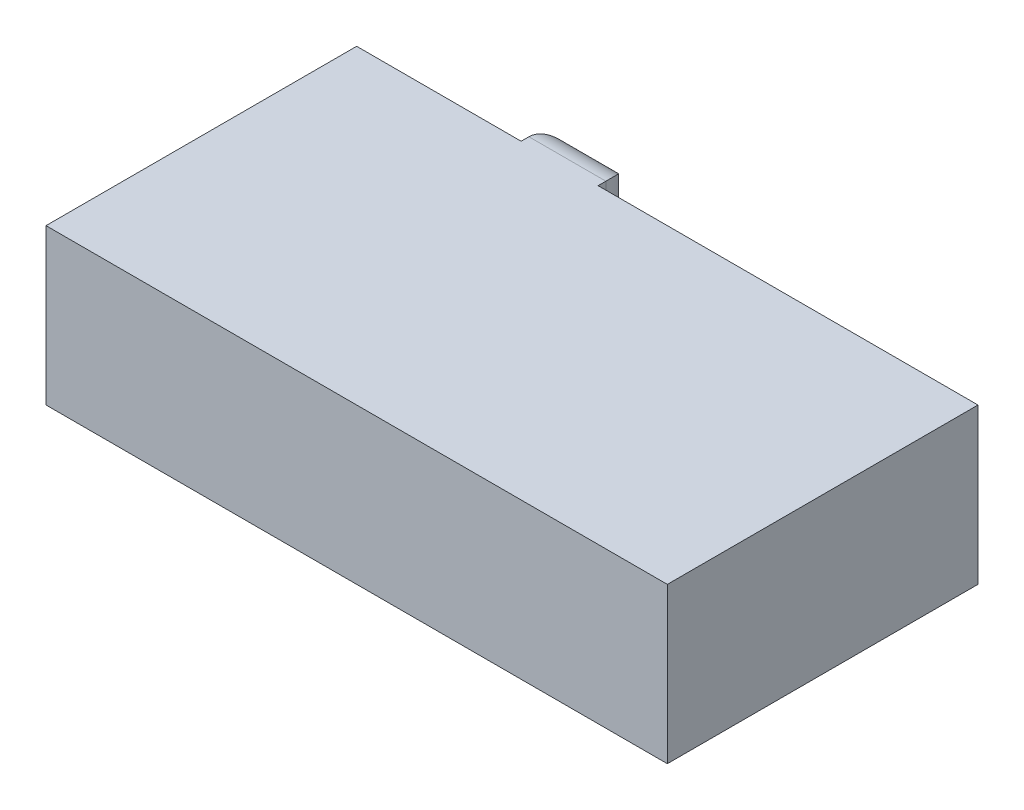
ISO-10303-21;
HEADER;
FILE_DESCRIPTION(('STEP AP214'),'2;1');
FILE_NAME('part.step','',(''),(''),'','','');
FILE_SCHEMA(('AUTOMOTIVE_DESIGN { 1 0 10303 214 1 1 1 1 }'));
ENDSEC;
DATA;
#1=APPLICATION_CONTEXT('core data for automotive mechanical design processes');
#2=APPLICATION_PROTOCOL_DEFINITION('international standard','automotive_design',2000,#1);
#3=PRODUCT_CONTEXT('',#1,'mechanical');
#4=PRODUCT('Part','Part','',(#3));
#5=PRODUCT_RELATED_PRODUCT_CATEGORY('part','',(#4));
#6=PRODUCT_DEFINITION_FORMATION('','',#4);
#7=PRODUCT_DEFINITION_CONTEXT('part definition',#1,'design');
#8=PRODUCT_DEFINITION('design','',#6,#7);
#9=PRODUCT_DEFINITION_SHAPE('','',#8);
#10=(LENGTH_UNIT() NAMED_UNIT(*) SI_UNIT(.MILLI.,.METRE.));
#11=(NAMED_UNIT(*) PLANE_ANGLE_UNIT() SI_UNIT($,.RADIAN.));
#12=(NAMED_UNIT(*) SI_UNIT($,.STERADIAN.) SOLID_ANGLE_UNIT());
#13=UNCERTAINTY_MEASURE_WITH_UNIT(LENGTH_MEASURE(1.E-05),#10,'distance_accuracy_value','');
#14=(GEOMETRIC_REPRESENTATION_CONTEXT(3) GLOBAL_UNCERTAINTY_ASSIGNED_CONTEXT((#13)) GLOBAL_UNIT_ASSIGNED_CONTEXT((#10,
#11,#12)) REPRESENTATION_CONTEXT('',''));
#15=CARTESIAN_POINT('',(0.,0.,0.));
#16=DIRECTION('',(0.,0.,1.));
#17=DIRECTION('',(1.,0.,0.));
#18=AXIS2_PLACEMENT_3D('',#15,#16,#17);
#19=CARTESIAN_POINT('',(0.,5.08,-10.16));
#20=DIRECTION('',(0.,0.,1.));
#21=DIRECTION('',(1.,0.,0.));
#22=AXIS2_PLACEMENT_3D('',#19,#20,#21);
#23=PLANE('',#22);
#24=DIRECTION('',(0.,-1.,0.));
#25=VECTOR('',#24,1.);
#26=CARTESIAN_POINT('',(7.89604556988621,5.08,-10.16));
#27=LINE('',#26,#25);
#28=CARTESIAN_POINT('',(7.89604556988621,5.08,-10.16));
#29=VERTEX_POINT('',#28);
#30=CARTESIAN_POINT('',(7.89604556988621,0.,-10.16));
#31=VERTEX_POINT('',#30);
#32=EDGE_CURVE('E123',#29,#31,#27,.T.);
#33=ORIENTED_EDGE('',*,*,#32,.F.);
#34=DIRECTION('',(-1.,0.,0.));
#35=VECTOR('',#34,1.);
#36=CARTESIAN_POINT('',(0.,5.08,-10.16));
#37=LINE('',#36,#35);
#38=CARTESIAN_POINT('',(20.32,5.08,-10.16));
#39=VERTEX_POINT('',#38);
#40=EDGE_CURVE('E151',#39,#29,#37,.T.);
#41=ORIENTED_EDGE('',*,*,#40,.F.);
#42=DIRECTION('',(0.,-1.,0.));
#43=VECTOR('',#42,1.);
#44=CARTESIAN_POINT('',(20.32,5.08,-10.16));
#45=LINE('',#44,#43);
#46=CARTESIAN_POINT('',(20.32,0.,-10.16));
#47=VERTEX_POINT('',#46);
#48=EDGE_CURVE('E126',#39,#47,#45,.T.);
#49=ORIENTED_EDGE('',*,*,#48,.T.);
#50=DIRECTION('',(-1.,0.,0.));
#51=VECTOR('',#50,1.);
#52=CARTESIAN_POINT('',(0.,0.,-10.16));
#53=LINE('',#52,#51);
#54=EDGE_CURVE('E112',#47,#31,#53,.T.);
#55=ORIENTED_EDGE('',*,*,#54,.T.);
#56=EDGE_LOOP('',(#33,#41,#49,#55));
#57=FACE_BOUND('',#56,.T.);
#58=ADVANCED_FACE('F33',(#57),#23,.F.);
#59=CARTESIAN_POINT('',(0.,5.08,0.));
#60=DIRECTION('',(1.,0.,0.));
#61=DIRECTION('',(0.,0.,-1.));
#62=AXIS2_PLACEMENT_3D('',#59,#60,#61);
#63=PLANE('',#62);
#64=DIRECTION('',(0.,0.,1.));
#65=VECTOR('',#64,1.);
#66=CARTESIAN_POINT('',(0.,0.,0.));
#67=LINE('',#66,#65);
#68=CARTESIAN_POINT('',(0.,0.,-10.16));
#69=VERTEX_POINT('',#68);
#70=CARTESIAN_POINT('',(0.,0.,0.));
#71=VERTEX_POINT('',#70);
#72=EDGE_CURVE('E143',#69,#71,#67,.T.);
#73=ORIENTED_EDGE('',*,*,#72,.T.);
#74=DIRECTION('',(0.,-1.,0.));
#75=VECTOR('',#74,1.);
#76=CARTESIAN_POINT('',(0.,5.08,0.));
#77=LINE('',#76,#75);
#78=CARTESIAN_POINT('',(0.,5.08,0.));
#79=VERTEX_POINT('',#78);
#80=EDGE_CURVE('E166',#79,#71,#77,.T.);
#81=ORIENTED_EDGE('',*,*,#80,.F.);
#82=DIRECTION('',(0.,0.,1.));
#83=VECTOR('',#82,1.);
#84=CARTESIAN_POINT('',(0.,5.08,0.));
#85=LINE('',#84,#83);
#86=CARTESIAN_POINT('',(0.,5.08,-10.16));
#87=VERTEX_POINT('',#86);
#88=EDGE_CURVE('E127',#87,#79,#85,.T.);
#89=ORIENTED_EDGE('',*,*,#88,.F.);
#90=DIRECTION('',(0.,-1.,0.));
#91=VECTOR('',#90,1.);
#92=CARTESIAN_POINT('',(0.,5.08,-10.16));
#93=LINE('',#92,#91);
#94=EDGE_CURVE('E153',#87,#69,#93,.T.);
#95=ORIENTED_EDGE('',*,*,#94,.T.);
#96=EDGE_LOOP('',(#73,#81,#89,#95));
#97=FACE_BOUND('',#96,.T.);
#98=ADVANCED_FACE('F216',(#97),#63,.F.);
#99=CARTESIAN_POINT('',(0.,5.08,0.));
#100=DIRECTION('',(0.,0.,-1.));
#101=DIRECTION('',(-1.,0.,0.));
#102=AXIS2_PLACEMENT_3D('',#99,#100,#101);
#103=PLANE('',#102);
#104=DIRECTION('',(1.,0.,0.));
#105=VECTOR('',#104,1.);
#106=CARTESIAN_POINT('',(0.,0.,0.));
#107=LINE('',#106,#105);
#108=CARTESIAN_POINT('',(20.32,0.,0.));
#109=VERTEX_POINT('',#108);
#110=EDGE_CURVE('E156',#71,#109,#107,.T.);
#111=ORIENTED_EDGE('',*,*,#110,.T.);
#112=DIRECTION('',(0.,-1.,0.));
#113=VECTOR('',#112,1.);
#114=CARTESIAN_POINT('',(20.32,5.08,0.));
#115=LINE('',#114,#113);
#116=CARTESIAN_POINT('',(20.32,5.08,0.));
#117=VERTEX_POINT('',#116);
#118=EDGE_CURVE('E163',#117,#109,#115,.T.);
#119=ORIENTED_EDGE('',*,*,#118,.F.);
#120=DIRECTION('',(1.,0.,0.));
#121=VECTOR('',#120,1.);
#122=CARTESIAN_POINT('',(0.,5.08,0.));
#123=LINE('',#122,#121);
#124=EDGE_CURVE('E146',#79,#117,#123,.T.);
#125=ORIENTED_EDGE('',*,*,#124,.F.);
#126=ORIENTED_EDGE('',*,*,#80,.T.);
#127=EDGE_LOOP('',(#111,#119,#125,#126));
#128=FACE_BOUND('',#127,.T.);
#129=ADVANCED_FACE('F221',(#128),#103,.F.);
#130=CARTESIAN_POINT('',(20.32,5.08,0.));
#131=DIRECTION('',(-1.,0.,0.));
#132=DIRECTION('',(0.,0.,1.));
#133=AXIS2_PLACEMENT_3D('',#130,#131,#132);
#134=PLANE('',#133);
#135=DIRECTION('',(0.,0.,-1.));
#136=VECTOR('',#135,1.);
#137=CARTESIAN_POINT('',(20.32,0.,0.));
#138=LINE('',#137,#136);
#139=EDGE_CURVE('E158',#109,#47,#138,.T.);
#140=ORIENTED_EDGE('',*,*,#139,.T.);
#141=ORIENTED_EDGE('',*,*,#48,.F.);
#142=DIRECTION('',(0.,0.,-1.));
#143=VECTOR('',#142,1.);
#144=CARTESIAN_POINT('',(20.32,5.08,0.));
#145=LINE('',#144,#143);
#146=EDGE_CURVE('E148',#117,#39,#145,.T.);
#147=ORIENTED_EDGE('',*,*,#146,.F.);
#148=ORIENTED_EDGE('',*,*,#118,.T.);
#149=EDGE_LOOP('',(#140,#141,#147,#148));
#150=FACE_BOUND('',#149,.T.);
#151=ADVANCED_FACE('F223',(#150),#134,.F.);
#152=CARTESIAN_POINT('',(5.37933212572739,5.08,-10.16));
#153=VERTEX_POINT('',#152);
#154=EDGE_CURVE('E150',#153,#87,#37,.T.);
#155=ORIENTED_EDGE('',*,*,#154,.F.);
#156=DIRECTION('',(0.,-1.,0.));
#157=VECTOR('',#156,1.);
#158=CARTESIAN_POINT('',(5.37933212572739,5.08,-10.16));
#159=LINE('',#158,#157);
#160=CARTESIAN_POINT('',(5.37933212572739,0.,-10.16));
#161=VERTEX_POINT('',#160);
#162=EDGE_CURVE('E132',#153,#161,#159,.T.);
#163=ORIENTED_EDGE('',*,*,#162,.T.);
#164=EDGE_CURVE('E128',#161,#69,#53,.T.);
#165=ORIENTED_EDGE('',*,*,#164,.T.);
#166=ORIENTED_EDGE('',*,*,#94,.F.);
#167=EDGE_LOOP('',(#155,#163,#165,#166));
#168=FACE_BOUND('',#167,.T.);
#169=ADVANCED_FACE('F211',(#168),#23,.F.);
#170=CARTESIAN_POINT('',(0.,5.08,0.));
#171=DIRECTION('',(0.,-1.,0.));
#172=DIRECTION('',(0.,0.,-1.));
#173=AXIS2_PLACEMENT_3D('',#170,#171,#172);
#174=PLANE('',#173);
#175=DIRECTION('',(0.,0.,1.));
#176=VECTOR('',#175,1.);
#177=CARTESIAN_POINT('',(7.89604556988621,5.08,-11.43));
#178=LINE('',#177,#176);
#179=CARTESIAN_POINT('',(7.89604556988621,5.08,-10.414));
#180=VERTEX_POINT('',#179);
#181=EDGE_CURVE('E116',#180,#29,#178,.T.);
#182=ORIENTED_EDGE('',*,*,#181,.F.);
#183=DIRECTION('',(1.,0.,0.));
#184=VECTOR('',#183,1.);
#185=CARTESIAN_POINT('',(5.37933212572739,5.08,-10.414));
#186=LINE('',#185,#184);
#187=CARTESIAN_POINT('',(5.37933212572739,5.08,-10.414));
#188=VERTEX_POINT('',#187);
#189=EDGE_CURVE('E178',#180,#188,#186,.F.);
#190=ORIENTED_EDGE('',*,*,#189,.T.);
#191=DIRECTION('',(0.,0.,1.));
#192=VECTOR('',#191,1.);
#193=CARTESIAN_POINT('',(5.37933212572739,5.08,-11.43));
#194=LINE('',#193,#192);
#195=EDGE_CURVE('E135',#188,#153,#194,.T.);
#196=ORIENTED_EDGE('',*,*,#195,.T.);
#197=ORIENTED_EDGE('',*,*,#154,.T.);
#198=ORIENTED_EDGE('',*,*,#88,.T.);
#199=ORIENTED_EDGE('',*,*,#124,.T.);
#200=ORIENTED_EDGE('',*,*,#146,.T.);
#201=ORIENTED_EDGE('',*,*,#40,.T.);
#202=EDGE_LOOP('',(#182,#190,#196,#197,#198,#199,#200,#201));
#203=FACE_BOUND('',#202,.T.);
#204=ADVANCED_FACE('F205',(#203),#174,.F.);
#205=CARTESIAN_POINT('',(0.,0.,0.));
#206=DIRECTION('',(0.,-1.,0.));
#207=DIRECTION('',(0.,0.,-1.));
#208=AXIS2_PLACEMENT_3D('',#205,#206,#207);
#209=PLANE('',#208);
#210=DIRECTION('',(0.,0.,1.));
#211=VECTOR('',#210,1.);
#212=CARTESIAN_POINT('',(5.37933212572739,0.,-11.43));
#213=LINE('',#212,#211);
#214=CARTESIAN_POINT('',(5.37933212572739,0.,-10.414));
#215=VERTEX_POINT('',#214);
#216=EDGE_CURVE('E117',#215,#161,#213,.T.);
#217=ORIENTED_EDGE('',*,*,#216,.F.);
#218=DIRECTION('',(1.,0.,0.));
#219=VECTOR('',#218,1.);
#220=CARTESIAN_POINT('',(0.,0.,-10.414));
#221=LINE('',#220,#219);
#222=CARTESIAN_POINT('',(7.89604556988621,0.,-10.414));
#223=VERTEX_POINT('',#222);
#224=EDGE_CURVE('E42',#215,#223,#221,.T.);
#225=ORIENTED_EDGE('',*,*,#224,.T.);
#226=DIRECTION('',(0.,0.,1.));
#227=VECTOR('',#226,1.);
#228=CARTESIAN_POINT('',(7.89604556988621,0.,-11.43));
#229=LINE('',#228,#227);
#230=EDGE_CURVE('E108',#223,#31,#229,.T.);
#231=ORIENTED_EDGE('',*,*,#230,.T.);
#232=ORIENTED_EDGE('',*,*,#54,.F.);
#233=ORIENTED_EDGE('',*,*,#139,.F.);
#234=ORIENTED_EDGE('',*,*,#110,.F.);
#235=ORIENTED_EDGE('',*,*,#72,.F.);
#236=ORIENTED_EDGE('',*,*,#164,.F.);
#237=EDGE_LOOP('',(#217,#225,#231,#232,#233,#234,#235,#236));
#238=FACE_BOUND('',#237,.T.);
#239=ADVANCED_FACE('F110',(#238),#209,.T.);
#240=CARTESIAN_POINT('',(7.89604556988621,5.08,-11.43));
#241=DIRECTION('',(-1.,0.,0.));
#242=DIRECTION('',(0.,0.,1.));
#243=AXIS2_PLACEMENT_3D('',#240,#241,#242);
#244=PLANE('',#243);
#245=ORIENTED_EDGE('',*,*,#230,.F.);
#246=DIRECTION('',(0.,-1.,0.));
#247=VECTOR('',#246,1.);
#248=CARTESIAN_POINT('',(7.89604556988621,5.08,-10.414));
#249=LINE('',#248,#247);
#250=EDGE_CURVE('E181',#223,#180,#249,.F.);
#251=ORIENTED_EDGE('',*,*,#250,.T.);
#252=ORIENTED_EDGE('',*,*,#181,.T.);
#253=ORIENTED_EDGE('',*,*,#32,.T.);
#254=EDGE_LOOP('',(#245,#251,#252,#253));
#255=FACE_BOUND('',#254,.T.);
#256=ADVANCED_FACE('F130',(#255),#244,.F.);
#257=CARTESIAN_POINT('',(5.37933212572739,5.08,-11.43));
#258=DIRECTION('',(-1.,0.,0.));
#259=DIRECTION('',(0.,0.,1.));
#260=AXIS2_PLACEMENT_3D('',#257,#258,#259);
#261=PLANE('',#260);
#262=ORIENTED_EDGE('',*,*,#195,.F.);
#263=DIRECTION('',(0.,-1.,0.));
#264=VECTOR('',#263,1.);
#265=CARTESIAN_POINT('',(5.37933212572739,5.08,-10.414));
#266=LINE('',#265,#264);
#267=EDGE_CURVE('E11',#188,#215,#266,.T.);
#268=ORIENTED_EDGE('',*,*,#267,.T.);
#269=ORIENTED_EDGE('',*,*,#216,.T.);
#270=ORIENTED_EDGE('',*,*,#162,.F.);
#271=EDGE_LOOP('',(#262,#268,#269,#270));
#272=FACE_BOUND('',#271,.T.);
#273=ADVANCED_FACE('F208',(#272),#261,.T.);
#274=CARTESIAN_POINT('',(0.,0.,-11.43));
#275=DIRECTION('',(0.,0.,-1.));
#276=DIRECTION('',(-1.,0.,0.));
#277=AXIS2_PLACEMENT_3D('',#274,#275,#276);
#278=PLANE('',#277);
#279=DIRECTION('',(0.,-1.,0.));
#280=VECTOR('',#279,1.);
#281=CARTESIAN_POINT('',(6.39533212572739,0.,-11.43));
#282=LINE('',#281,#280);
#283=CARTESIAN_POINT('',(6.39533212572739,1.016,-11.43));
#284=VERTEX_POINT('',#283);
#285=CARTESIAN_POINT('',(6.39533212572739,4.064,-11.43));
#286=VERTEX_POINT('',#285);
#287=EDGE_CURVE('E169',#284,#286,#282,.F.);
#288=ORIENTED_EDGE('',*,*,#287,.T.);
#289=DIRECTION('',(1.,0.,0.));
#290=VECTOR('',#289,1.);
#291=CARTESIAN_POINT('',(7.89604556988621,4.064,-11.43));
#292=LINE('',#291,#290);
#293=CARTESIAN_POINT('',(6.88004556988621,4.064,-11.43));
#294=VERTEX_POINT('',#293);
#295=EDGE_CURVE('E175',#286,#294,#292,.T.);
#296=ORIENTED_EDGE('',*,*,#295,.T.);
#297=DIRECTION('',(0.,-1.,0.));
#298=VECTOR('',#297,1.);
#299=CARTESIAN_POINT('',(6.88004556988621,0.,-11.43));
#300=LINE('',#299,#298);
#301=CARTESIAN_POINT('',(6.88004556988621,1.016,-11.43));
#302=VERTEX_POINT('',#301);
#303=EDGE_CURVE('E173',#294,#302,#300,.T.);
#304=ORIENTED_EDGE('',*,*,#303,.T.);
#305=DIRECTION('',(1.,0.,0.));
#306=VECTOR('',#305,1.);
#307=CARTESIAN_POINT('',(0.,1.016,-11.43));
#308=LINE('',#307,#306);
#309=EDGE_CURVE('E171',#302,#284,#308,.F.);
#310=ORIENTED_EDGE('',*,*,#309,.T.);
#311=EDGE_LOOP('',(#288,#296,#304,#310));
#312=FACE_BOUND('',#311,.T.);
#313=ADVANCED_FACE('F198',(#312),#278,.T.);
#314=CARTESIAN_POINT('',(0.,1.016,-10.414));
#315=DIRECTION('',(1.,0.,0.));
#316=DIRECTION('',(0.,0.,-1.));
#317=AXIS2_PLACEMENT_3D('',#314,#315,#316);
#318=CYLINDRICAL_SURFACE('',#317,1.016);
#319=CARTESIAN_POINT('',(6.88004556988621,1.016,-10.414));
#320=DIRECTION('',(0.707106781186547,0.707106781186547,0.));
#321=DIRECTION('',(0.707106781186547,-0.707106781186547,0.));
#322=AXIS2_PLACEMENT_3D('',#319,#320,#321);
#323=ELLIPSE('',#322,1.43684097937106,1.016);
#324=EDGE_CURVE('E138',#223,#302,#323,.T.);
#325=ORIENTED_EDGE('',*,*,#324,.F.);
#326=ORIENTED_EDGE('',*,*,#224,.F.);
#327=CARTESIAN_POINT('',(6.39533212572739,1.016,-10.414));
#328=DIRECTION('',(0.707106781186547,-0.707106781186547,0.));
#329=DIRECTION('',(-0.707106781186547,-0.707106781186547,0.));
#330=AXIS2_PLACEMENT_3D('',#327,#328,#329);
#331=ELLIPSE('',#330,1.43684097937106,1.016);
#332=EDGE_CURVE('E37',#284,#215,#331,.F.);
#333=ORIENTED_EDGE('',*,*,#332,.F.);
#334=ORIENTED_EDGE('',*,*,#309,.F.);
#335=EDGE_LOOP('',(#325,#326,#333,#334));
#336=FACE_BOUND('',#335,.T.);
#337=ADVANCED_FACE('F35',(#336),#318,.T.);
#338=CARTESIAN_POINT('',(6.39533212572739,5.08,-10.414));
#339=DIRECTION('',(0.,-1.,0.));
#340=DIRECTION('',(0.,0.,-1.));
#341=AXIS2_PLACEMENT_3D('',#338,#339,#340);
#342=CYLINDRICAL_SURFACE('',#341,1.016);
#343=ORIENTED_EDGE('',*,*,#332,.T.);
#344=ORIENTED_EDGE('',*,*,#267,.F.);
#345=CARTESIAN_POINT('',(6.39533212572739,4.064,-10.414));
#346=DIRECTION('',(-0.707106781186547,-0.707106781186547,0.));
#347=DIRECTION('',(0.707106781186547,-0.707106781186547,0.));
#348=AXIS2_PLACEMENT_3D('',#345,#346,#347);
#349=ELLIPSE('',#348,1.43684097937106,1.016);
#350=EDGE_CURVE('E186',#286,#188,#349,.F.);
#351=ORIENTED_EDGE('',*,*,#350,.F.);
#352=ORIENTED_EDGE('',*,*,#287,.F.);
#353=EDGE_LOOP('',(#343,#344,#351,#352));
#354=FACE_BOUND('',#353,.T.);
#355=ADVANCED_FACE('F250',(#354),#342,.T.);
#356=CARTESIAN_POINT('',(6.88004556988621,0.,-10.414));
#357=DIRECTION('',(0.,1.,0.));
#358=DIRECTION('',(0.,0.,1.));
#359=AXIS2_PLACEMENT_3D('',#356,#357,#358);
#360=CYLINDRICAL_SURFACE('',#359,1.016);
#361=ORIENTED_EDGE('',*,*,#324,.T.);
#362=ORIENTED_EDGE('',*,*,#303,.F.);
#363=CARTESIAN_POINT('',(6.88004556988621,4.064,-10.414));
#364=DIRECTION('',(-0.707106781186547,0.707106781186547,0.));
#365=DIRECTION('',(0.707106781186547,0.707106781186547,0.));
#366=AXIS2_PLACEMENT_3D('',#363,#364,#365);
#367=ELLIPSE('',#366,1.43684097937106,1.016);
#368=EDGE_CURVE('E184',#180,#294,#367,.T.);
#369=ORIENTED_EDGE('',*,*,#368,.F.);
#370=ORIENTED_EDGE('',*,*,#250,.F.);
#371=EDGE_LOOP('',(#361,#362,#369,#370));
#372=FACE_BOUND('',#371,.T.);
#373=ADVANCED_FACE('F191',(#372),#360,.T.);
#374=CARTESIAN_POINT('',(0.,4.064,-10.414));
#375=DIRECTION('',(-1.,0.,0.));
#376=DIRECTION('',(0.,0.,1.));
#377=AXIS2_PLACEMENT_3D('',#374,#375,#376);
#378=CYLINDRICAL_SURFACE('',#377,1.016);
#379=ORIENTED_EDGE('',*,*,#350,.T.);
#380=ORIENTED_EDGE('',*,*,#189,.F.);
#381=ORIENTED_EDGE('',*,*,#368,.T.);
#382=ORIENTED_EDGE('',*,*,#295,.F.);
#383=EDGE_LOOP('',(#379,#380,#381,#382));
#384=FACE_BOUND('',#383,.T.);
#385=ADVANCED_FACE('F202',(#384),#378,.T.);
#386=CLOSED_SHELL('',(#58,#98,#129,#151,#169,#204,#239,#256,#273,#313,#337,#355,#373,#385));
#387=MANIFOLD_SOLID_BREP('B2',#386);
#388=ADVANCED_BREP_SHAPE_REPRESENTATION('',(#18,#387),#14);
#389=SHAPE_DEFINITION_REPRESENTATION(#9,#388);
ENDSEC;
END-ISO-10303-21;
